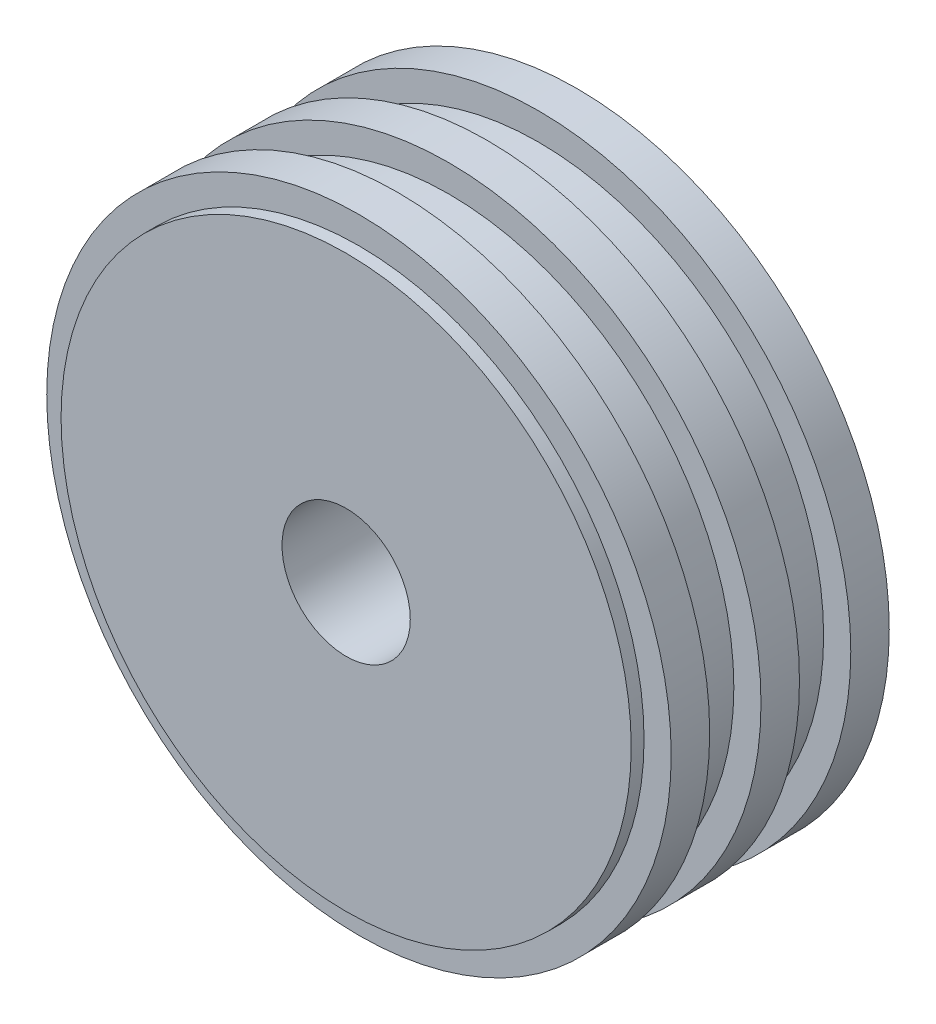
ISO-10303-21;
HEADER;
FILE_DESCRIPTION(('STEP AP214'),'2;1');
FILE_NAME('part.step','',(''),(''),'','','');
FILE_SCHEMA(('AUTOMOTIVE_DESIGN { 1 0 10303 214 1 1 1 1 }'));
ENDSEC;
DATA;
#1=APPLICATION_CONTEXT('core data for automotive mechanical design processes');
#2=APPLICATION_PROTOCOL_DEFINITION('international standard','automotive_design',2000,#1);
#3=PRODUCT_CONTEXT('',#1,'mechanical');
#4=PRODUCT('Part','Part','',(#3));
#5=PRODUCT_RELATED_PRODUCT_CATEGORY('part','',(#4));
#6=PRODUCT_DEFINITION_FORMATION('','',#4);
#7=PRODUCT_DEFINITION_CONTEXT('part definition',#1,'design');
#8=PRODUCT_DEFINITION('design','',#6,#7);
#9=PRODUCT_DEFINITION_SHAPE('','',#8);
#10=(LENGTH_UNIT() NAMED_UNIT(*) SI_UNIT(.MILLI.,.METRE.));
#11=(NAMED_UNIT(*) PLANE_ANGLE_UNIT() SI_UNIT($,.RADIAN.));
#12=(NAMED_UNIT(*) SI_UNIT($,.STERADIAN.) SOLID_ANGLE_UNIT());
#13=UNCERTAINTY_MEASURE_WITH_UNIT(LENGTH_MEASURE(1.E-05),#10,'distance_accuracy_value','');
#14=(GEOMETRIC_REPRESENTATION_CONTEXT(3) GLOBAL_UNCERTAINTY_ASSIGNED_CONTEXT((#13)) GLOBAL_UNIT_ASSIGNED_CONTEXT((#10,
#11,#12)) REPRESENTATION_CONTEXT('',''));
#15=CARTESIAN_POINT('',(0.,0.,0.));
#16=DIRECTION('',(0.,0.,1.));
#17=DIRECTION('',(1.,0.,0.));
#18=AXIS2_PLACEMENT_3D('',#15,#16,#17);
#19=CARTESIAN_POINT('',(0.,0.,-57.));
#20=DIRECTION('',(0.,0.,1.));
#21=DIRECTION('',(1.,0.,0.));
#22=AXIS2_PLACEMENT_3D('',#19,#20,#21);
#23=CYLINDRICAL_SURFACE('',#22,66.675);
#24=CARTESIAN_POINT('',(0.,0.,-57.));
#25=DIRECTION('',(0.,0.,1.));
#26=DIRECTION('',(1.,0.,0.));
#27=AXIS2_PLACEMENT_3D('',#24,#25,#26);
#28=CIRCLE('',#27,66.675);
#29=CARTESIAN_POINT('',(66.675,0.,-57.));
#30=VERTEX_POINT('',#29);
#31=EDGE_CURVE('E46',#30,#30,#28,.T.);
#32=ORIENTED_EDGE('',*,*,#31,.T.);
#33=EDGE_LOOP('',(#32));
#34=FACE_BOUND('',#33,.T.);
#35=CARTESIAN_POINT('',(0.,0.,-54.));
#36=DIRECTION('',(0.,0.,1.));
#37=DIRECTION('',(1.,0.,0.));
#38=AXIS2_PLACEMENT_3D('',#35,#36,#37);
#39=CIRCLE('',#38,66.675);
#40=CARTESIAN_POINT('',(66.675,0.,-54.));
#41=VERTEX_POINT('',#40);
#42=EDGE_CURVE('E82',#41,#41,#39,.T.);
#43=ORIENTED_EDGE('',*,*,#42,.F.);
#44=EDGE_LOOP('',(#43));
#45=FACE_BOUND('',#44,.T.);
#46=ADVANCED_FACE('F31',(#34,#45),#23,.T.);
#47=CARTESIAN_POINT('',(0.,0.,-45.));
#48=DIRECTION('',(0.,0.,1.));
#49=DIRECTION('',(1.,0.,0.));
#50=AXIS2_PLACEMENT_3D('',#47,#48,#49);
#51=CIRCLE('',#50,66.675);
#52=CARTESIAN_POINT('',(66.675,0.,-45.));
#53=VERTEX_POINT('',#52);
#54=EDGE_CURVE('E10',#53,#53,#51,.F.);
#55=ORIENTED_EDGE('',*,*,#54,.F.);
#56=EDGE_LOOP('',(#55));
#57=FACE_BOUND('',#56,.T.);
#58=CARTESIAN_POINT('',(0.,0.,-33.));
#59=DIRECTION('',(0.,0.,1.));
#60=DIRECTION('',(1.,0.,0.));
#61=AXIS2_PLACEMENT_3D('',#58,#59,#60);
#62=CIRCLE('',#61,66.675);
#63=CARTESIAN_POINT('',(66.675,0.,-33.));
#64=VERTEX_POINT('',#63);
#65=EDGE_CURVE('E73',#64,#64,#62,.T.);
#66=ORIENTED_EDGE('',*,*,#65,.F.);
#67=EDGE_LOOP('',(#66));
#68=FACE_BOUND('',#67,.T.);
#69=ADVANCED_FACE('F92',(#57,#68),#23,.T.);
#70=CARTESIAN_POINT('',(0.,0.,-24.));
#71=DIRECTION('',(0.,0.,1.));
#72=DIRECTION('',(1.,0.,0.));
#73=AXIS2_PLACEMENT_3D('',#70,#71,#72);
#74=CIRCLE('',#73,66.675);
#75=CARTESIAN_POINT('',(66.675,0.,-24.));
#76=VERTEX_POINT('',#75);
#77=EDGE_CURVE('E38',#76,#76,#74,.F.);
#78=ORIENTED_EDGE('',*,*,#77,.F.);
#79=EDGE_LOOP('',(#78));
#80=FACE_BOUND('',#79,.T.);
#81=CARTESIAN_POINT('',(0.,0.,-12.));
#82=DIRECTION('',(0.,0.,1.));
#83=DIRECTION('',(1.,0.,0.));
#84=AXIS2_PLACEMENT_3D('',#81,#82,#83);
#85=CIRCLE('',#84,66.675);
#86=CARTESIAN_POINT('',(66.675,0.,-12.));
#87=VERTEX_POINT('',#86);
#88=EDGE_CURVE('E64',#87,#87,#85,.T.);
#89=ORIENTED_EDGE('',*,*,#88,.F.);
#90=EDGE_LOOP('',(#89));
#91=FACE_BOUND('',#90,.T.);
#92=ADVANCED_FACE('F97',(#80,#91),#23,.T.);
#93=CARTESIAN_POINT('',(0.,0.,-3.));
#94=DIRECTION('',(0.,0.,1.));
#95=DIRECTION('',(1.,0.,0.));
#96=AXIS2_PLACEMENT_3D('',#93,#94,#95);
#97=CIRCLE('',#96,66.675);
#98=CARTESIAN_POINT('',(66.675,0.,-3.));
#99=VERTEX_POINT('',#98);
#100=EDGE_CURVE('E42',#99,#99,#97,.F.);
#101=ORIENTED_EDGE('',*,*,#100,.F.);
#102=EDGE_LOOP('',(#101));
#103=FACE_BOUND('',#102,.T.);
#104=CARTESIAN_POINT('',(0.,0.,0.));
#105=DIRECTION('',(0.,0.,1.));
#106=DIRECTION('',(1.,0.,0.));
#107=AXIS2_PLACEMENT_3D('',#104,#105,#106);
#108=CIRCLE('',#107,66.675);
#109=CARTESIAN_POINT('',(66.675,0.,0.));
#110=VERTEX_POINT('',#109);
#111=EDGE_CURVE('E49',#110,#110,#108,.T.);
#112=ORIENTED_EDGE('',*,*,#111,.F.);
#113=EDGE_LOOP('',(#112));
#114=FACE_BOUND('',#113,.T.);
#115=ADVANCED_FACE('F33',(#103,#114),#23,.T.);
#116=CARTESIAN_POINT('',(0.,0.,-57.));
#117=DIRECTION('',(0.,0.,1.));
#118=DIRECTION('',(1.,0.,0.));
#119=AXIS2_PLACEMENT_3D('',#116,#117,#118);
#120=PLANE('',#119);
#121=CARTESIAN_POINT('',(0.,0.,-57.));
#122=DIRECTION('',(0.,0.,1.));
#123=DIRECTION('',(1.,0.,0.));
#124=AXIS2_PLACEMENT_3D('',#121,#122,#123);
#125=CIRCLE('',#124,15.);
#126=CARTESIAN_POINT('',(15.,0.,-57.));
#127=VERTEX_POINT('',#126);
#128=EDGE_CURVE('E52',#127,#127,#125,.T.);
#129=ORIENTED_EDGE('',*,*,#128,.T.);
#130=EDGE_LOOP('',(#129));
#131=FACE_BOUND('',#130,.T.);
#132=ORIENTED_EDGE('',*,*,#31,.F.);
#133=EDGE_LOOP('',(#132));
#134=FACE_BOUND('',#133,.T.);
#135=ADVANCED_FACE('F100',(#131,#134),#120,.F.);
#136=CARTESIAN_POINT('',(0.,0.,0.));
#137=DIRECTION('',(0.,0.,1.));
#138=DIRECTION('',(1.,0.,0.));
#139=AXIS2_PLACEMENT_3D('',#136,#137,#138);
#140=PLANE('',#139);
#141=CARTESIAN_POINT('',(0.,0.,0.));
#142=DIRECTION('',(0.,0.,1.));
#143=DIRECTION('',(1.,0.,0.));
#144=AXIS2_PLACEMENT_3D('',#141,#142,#143);
#145=CIRCLE('',#144,15.);
#146=CARTESIAN_POINT('',(15.,0.,0.));
#147=VERTEX_POINT('',#146);
#148=EDGE_CURVE('E55',#147,#147,#145,.T.);
#149=ORIENTED_EDGE('',*,*,#148,.F.);
#150=EDGE_LOOP('',(#149));
#151=FACE_BOUND('',#150,.T.);
#152=ORIENTED_EDGE('',*,*,#111,.T.);
#153=EDGE_LOOP('',(#152));
#154=FACE_BOUND('',#153,.T.);
#155=ADVANCED_FACE('F106',(#151,#154),#140,.T.);
#156=CARTESIAN_POINT('',(0.,0.,-57.));
#157=DIRECTION('',(0.,0.,1.));
#158=DIRECTION('',(1.,0.,0.));
#159=AXIS2_PLACEMENT_3D('',#156,#157,#158);
#160=CYLINDRICAL_SURFACE('',#159,15.);
#161=ORIENTED_EDGE('',*,*,#128,.F.);
#162=EDGE_LOOP('',(#161));
#163=FACE_BOUND('',#162,.T.);
#164=ORIENTED_EDGE('',*,*,#148,.T.);
#165=EDGE_LOOP('',(#164));
#166=FACE_BOUND('',#165,.T.);
#167=ADVANCED_FACE('F115',(#163,#166),#160,.F.);
#168=CARTESIAN_POINT('',(0.,0.,-12.));
#169=DIRECTION('',(0.,0.,1.));
#170=DIRECTION('',(1.,0.,0.));
#171=AXIS2_PLACEMENT_3D('',#168,#169,#170);
#172=CYLINDRICAL_SURFACE('',#171,73.025);
#173=CARTESIAN_POINT('',(0.,0.,-12.));
#174=DIRECTION('',(0.,0.,1.));
#175=DIRECTION('',(1.,0.,0.));
#176=AXIS2_PLACEMENT_3D('',#173,#174,#175);
#177=CIRCLE('',#176,73.025);
#178=CARTESIAN_POINT('',(73.025,0.,-12.));
#179=VERTEX_POINT('',#178);
#180=EDGE_CURVE('E58',#179,#179,#177,.T.);
#181=ORIENTED_EDGE('',*,*,#180,.T.);
#182=EDGE_LOOP('',(#181));
#183=FACE_BOUND('',#182,.T.);
#184=CARTESIAN_POINT('',(0.,0.,-3.));
#185=DIRECTION('',(0.,0.,1.));
#186=DIRECTION('',(1.,0.,0.));
#187=AXIS2_PLACEMENT_3D('',#184,#185,#186);
#188=CIRCLE('',#187,73.025);
#189=CARTESIAN_POINT('',(73.025,0.,-3.));
#190=VERTEX_POINT('',#189);
#191=EDGE_CURVE('E61',#190,#190,#188,.T.);
#192=ORIENTED_EDGE('',*,*,#191,.F.);
#193=EDGE_LOOP('',(#192));
#194=FACE_BOUND('',#193,.T.);
#195=ADVANCED_FACE('F120',(#183,#194),#172,.T.);
#196=CARTESIAN_POINT('',(0.,0.,-12.));
#197=DIRECTION('',(0.,0.,1.));
#198=DIRECTION('',(1.,0.,0.));
#199=AXIS2_PLACEMENT_3D('',#196,#197,#198);
#200=PLANE('',#199);
#201=ORIENTED_EDGE('',*,*,#88,.T.);
#202=EDGE_LOOP('',(#201));
#203=FACE_BOUND('',#202,.T.);
#204=ORIENTED_EDGE('',*,*,#180,.F.);
#205=EDGE_LOOP('',(#204));
#206=FACE_BOUND('',#205,.T.);
#207=ADVANCED_FACE('F127',(#203,#206),#200,.F.);
#208=CARTESIAN_POINT('',(0.,0.,-3.));
#209=DIRECTION('',(0.,0.,1.));
#210=DIRECTION('',(1.,0.,0.));
#211=AXIS2_PLACEMENT_3D('',#208,#209,#210);
#212=PLANE('',#211);
#213=ORIENTED_EDGE('',*,*,#100,.T.);
#214=EDGE_LOOP('',(#213));
#215=FACE_BOUND('',#214,.T.);
#216=ORIENTED_EDGE('',*,*,#191,.T.);
#217=EDGE_LOOP('',(#216));
#218=FACE_BOUND('',#217,.T.);
#219=ADVANCED_FACE('F129',(#215,#218),#212,.T.);
#220=CARTESIAN_POINT('',(0.,0.,-33.));
#221=DIRECTION('',(0.,0.,1.));
#222=DIRECTION('',(1.,0.,0.));
#223=AXIS2_PLACEMENT_3D('',#220,#221,#222);
#224=CYLINDRICAL_SURFACE('',#223,73.025);
#225=CARTESIAN_POINT('',(0.,0.,-33.));
#226=DIRECTION('',(0.,0.,1.));
#227=DIRECTION('',(1.,0.,0.));
#228=AXIS2_PLACEMENT_3D('',#225,#226,#227);
#229=CIRCLE('',#228,73.025);
#230=CARTESIAN_POINT('',(73.025,0.,-33.));
#231=VERTEX_POINT('',#230);
#232=EDGE_CURVE('E69',#231,#231,#229,.T.);
#233=ORIENTED_EDGE('',*,*,#232,.T.);
#234=EDGE_LOOP('',(#233));
#235=FACE_BOUND('',#234,.T.);
#236=CARTESIAN_POINT('',(0.,0.,-24.));
#237=DIRECTION('',(0.,0.,1.));
#238=DIRECTION('',(1.,0.,0.));
#239=AXIS2_PLACEMENT_3D('',#236,#237,#238);
#240=CIRCLE('',#239,73.025);
#241=CARTESIAN_POINT('',(73.025,0.,-24.));
#242=VERTEX_POINT('',#241);
#243=EDGE_CURVE('E70',#242,#242,#240,.T.);
#244=ORIENTED_EDGE('',*,*,#243,.F.);
#245=EDGE_LOOP('',(#244));
#246=FACE_BOUND('',#245,.T.);
#247=ADVANCED_FACE('F132',(#235,#246),#224,.T.);
#248=CARTESIAN_POINT('',(0.,0.,-33.));
#249=DIRECTION('',(0.,0.,1.));
#250=DIRECTION('',(1.,0.,0.));
#251=AXIS2_PLACEMENT_3D('',#248,#249,#250);
#252=PLANE('',#251);
#253=ORIENTED_EDGE('',*,*,#65,.T.);
#254=EDGE_LOOP('',(#253));
#255=FACE_BOUND('',#254,.T.);
#256=ORIENTED_EDGE('',*,*,#232,.F.);
#257=EDGE_LOOP('',(#256));
#258=FACE_BOUND('',#257,.T.);
#259=ADVANCED_FACE('F139',(#255,#258),#252,.F.);
#260=CARTESIAN_POINT('',(0.,0.,-24.));
#261=DIRECTION('',(0.,0.,1.));
#262=DIRECTION('',(1.,0.,0.));
#263=AXIS2_PLACEMENT_3D('',#260,#261,#262);
#264=PLANE('',#263);
#265=ORIENTED_EDGE('',*,*,#77,.T.);
#266=EDGE_LOOP('',(#265));
#267=FACE_BOUND('',#266,.T.);
#268=ORIENTED_EDGE('',*,*,#243,.T.);
#269=EDGE_LOOP('',(#268));
#270=FACE_BOUND('',#269,.T.);
#271=ADVANCED_FACE('F141',(#267,#270),#264,.T.);
#272=CARTESIAN_POINT('',(0.,0.,-54.));
#273=DIRECTION('',(0.,0.,1.));
#274=DIRECTION('',(1.,0.,0.));
#275=AXIS2_PLACEMENT_3D('',#272,#273,#274);
#276=CYLINDRICAL_SURFACE('',#275,73.025);
#277=CARTESIAN_POINT('',(0.,0.,-54.));
#278=DIRECTION('',(0.,0.,1.));
#279=DIRECTION('',(1.,0.,0.));
#280=AXIS2_PLACEMENT_3D('',#277,#278,#279);
#281=CIRCLE('',#280,73.025);
#282=CARTESIAN_POINT('',(73.025,0.,-54.));
#283=VERTEX_POINT('',#282);
#284=EDGE_CURVE('E78',#283,#283,#281,.T.);
#285=ORIENTED_EDGE('',*,*,#284,.T.);
#286=EDGE_LOOP('',(#285));
#287=FACE_BOUND('',#286,.T.);
#288=CARTESIAN_POINT('',(0.,0.,-45.));
#289=DIRECTION('',(0.,0.,1.));
#290=DIRECTION('',(1.,0.,0.));
#291=AXIS2_PLACEMENT_3D('',#288,#289,#290);
#292=CIRCLE('',#291,73.025);
#293=CARTESIAN_POINT('',(73.025,0.,-45.));
#294=VERTEX_POINT('',#293);
#295=EDGE_CURVE('E79',#294,#294,#292,.T.);
#296=ORIENTED_EDGE('',*,*,#295,.F.);
#297=EDGE_LOOP('',(#296));
#298=FACE_BOUND('',#297,.T.);
#299=ADVANCED_FACE('F144',(#287,#298),#276,.T.);
#300=CARTESIAN_POINT('',(0.,0.,-54.));
#301=DIRECTION('',(0.,0.,1.));
#302=DIRECTION('',(1.,0.,0.));
#303=AXIS2_PLACEMENT_3D('',#300,#301,#302);
#304=PLANE('',#303);
#305=ORIENTED_EDGE('',*,*,#42,.T.);
#306=EDGE_LOOP('',(#305));
#307=FACE_BOUND('',#306,.T.);
#308=ORIENTED_EDGE('',*,*,#284,.F.);
#309=EDGE_LOOP('',(#308));
#310=FACE_BOUND('',#309,.T.);
#311=ADVANCED_FACE('F88',(#307,#310),#304,.F.);
#312=CARTESIAN_POINT('',(0.,0.,-45.));
#313=DIRECTION('',(0.,0.,1.));
#314=DIRECTION('',(1.,0.,0.));
#315=AXIS2_PLACEMENT_3D('',#312,#313,#314);
#316=PLANE('',#315);
#317=ORIENTED_EDGE('',*,*,#54,.T.);
#318=EDGE_LOOP('',(#317));
#319=FACE_BOUND('',#318,.T.);
#320=ORIENTED_EDGE('',*,*,#295,.T.);
#321=EDGE_LOOP('',(#320));
#322=FACE_BOUND('',#321,.T.);
#323=ADVANCED_FACE('F151',(#319,#322),#316,.T.);
#324=CLOSED_SHELL('',(#46,#69,#92,#115,#135,#155,#167,#195,#207,#219,#247,#259,#271,#299,#311,#323));
#325=MANIFOLD_SOLID_BREP('B2',#324);
#326=ADVANCED_BREP_SHAPE_REPRESENTATION('',(#18,#325),#14);
#327=SHAPE_DEFINITION_REPRESENTATION(#9,#326);
ENDSEC;
END-ISO-10303-21;
